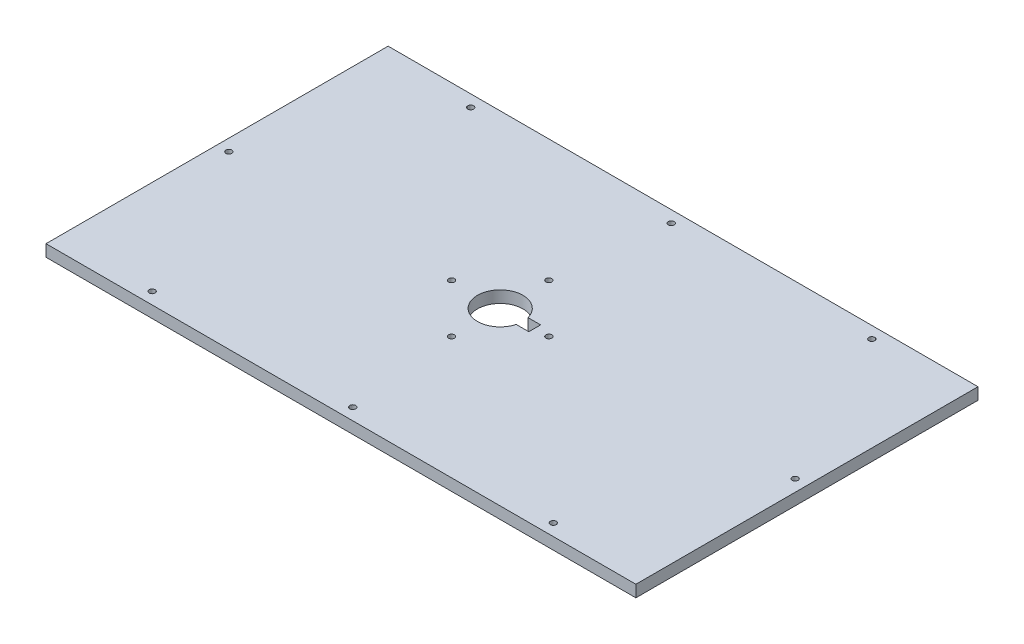
ISO-10303-21;
HEADER;
FILE_DESCRIPTION(('STEP AP214'),'2;1');
FILE_NAME('part.step','',(''),(''),'','','');
FILE_SCHEMA(('AUTOMOTIVE_DESIGN { 1 0 10303 214 1 1 1 1 }'));
ENDSEC;
DATA;
#1=APPLICATION_CONTEXT('core data for automotive mechanical design processes');
#2=APPLICATION_PROTOCOL_DEFINITION('international standard','automotive_design',2000,#1);
#3=PRODUCT_CONTEXT('',#1,'mechanical');
#4=PRODUCT('Part','Part','',(#3));
#5=PRODUCT_RELATED_PRODUCT_CATEGORY('part','',(#4));
#6=PRODUCT_DEFINITION_FORMATION('','',#4);
#7=PRODUCT_DEFINITION_CONTEXT('part definition',#1,'design');
#8=PRODUCT_DEFINITION('design','',#6,#7);
#9=PRODUCT_DEFINITION_SHAPE('','',#8);
#10=(LENGTH_UNIT() NAMED_UNIT(*) SI_UNIT(.MILLI.,.METRE.));
#11=(NAMED_UNIT(*) PLANE_ANGLE_UNIT() SI_UNIT($,.RADIAN.));
#12=(NAMED_UNIT(*) SI_UNIT($,.STERADIAN.) SOLID_ANGLE_UNIT());
#13=UNCERTAINTY_MEASURE_WITH_UNIT(LENGTH_MEASURE(1.E-05),#10,'distance_accuracy_value','');
#14=(GEOMETRIC_REPRESENTATION_CONTEXT(3) GLOBAL_UNCERTAINTY_ASSIGNED_CONTEXT((#13)) GLOBAL_UNIT_ASSIGNED_CONTEXT((#10,
#11,#12)) REPRESENTATION_CONTEXT('',''));
#15=CARTESIAN_POINT('',(0.,0.,0.));
#16=DIRECTION('',(0.,0.,1.));
#17=DIRECTION('',(1.,0.,0.));
#18=AXIS2_PLACEMENT_3D('',#15,#16,#17);
#19=CARTESIAN_POINT('',(0.,10.,0.));
#20=DIRECTION('',(0.,-1.,0.));
#21=DIRECTION('',(0.,0.,-1.));
#22=AXIS2_PLACEMENT_3D('',#19,#20,#21);
#23=PLANE('',#22);
#24=CARTESIAN_POINT('',(-10.,10.,41.25));
#25=DIRECTION('',(0.,1.,0.));
#26=DIRECTION('',(0.,0.,1.));
#27=AXIS2_PLACEMENT_3D('',#24,#25,#26);
#28=CIRCLE('',#27,2.5);
#29=CARTESIAN_POINT('',(-10.,10.,43.75));
#30=VERTEX_POINT('',#29);
#31=EDGE_CURVE('E141',#30,#30,#28,.T.);
#32=ORIENTED_EDGE('',*,*,#31,.F.);
#33=EDGE_LOOP('',(#32));
#34=FACE_BOUND('',#33,.T.);
#35=CARTESIAN_POINT('',(1.11022302462516E-13,10.,135.));
#36=DIRECTION('',(0.,1.,0.));
#37=DIRECTION('',(0.,0.,1.));
#38=AXIS2_PLACEMENT_3D('',#35,#36,#37);
#39=CIRCLE('',#38,2.5);
#40=CARTESIAN_POINT('',(1.11022302462516E-13,10.,137.5));
#41=VERTEX_POINT('',#40);
#42=EDGE_CURVE('E147',#41,#41,#39,.T.);
#43=ORIENTED_EDGE('',*,*,#42,.F.);
#44=EDGE_LOOP('',(#43));
#45=FACE_BOUND('',#44,.T.);
#46=CARTESIAN_POINT('',(1.11022302462516E-13,10.,-135.));
#47=DIRECTION('',(0.,1.,0.));
#48=DIRECTION('',(0.,0.,1.));
#49=AXIS2_PLACEMENT_3D('',#46,#47,#48);
#50=CIRCLE('',#49,2.5);
#51=CARTESIAN_POINT('',(1.11022302462516E-13,10.,-132.5));
#52=VERTEX_POINT('',#51);
#53=EDGE_CURVE('E153',#52,#52,#50,.T.);
#54=ORIENTED_EDGE('',*,*,#53,.F.);
#55=EDGE_LOOP('',(#54));
#56=FACE_BOUND('',#55,.T.);
#57=CARTESIAN_POINT('',(170.,10.,135.));
#58=DIRECTION('',(0.,1.,0.));
#59=DIRECTION('',(0.,0.,1.));
#60=AXIS2_PLACEMENT_3D('',#57,#58,#59);
#61=CIRCLE('',#60,2.5);
#62=CARTESIAN_POINT('',(170.,10.,137.5));
#63=VERTEX_POINT('',#62);
#64=EDGE_CURVE('E159',#63,#63,#61,.T.);
#65=ORIENTED_EDGE('',*,*,#64,.F.);
#66=EDGE_LOOP('',(#65));
#67=FACE_BOUND('',#66,.T.);
#68=CARTESIAN_POINT('',(240.,10.,0.));
#69=DIRECTION('',(0.,1.,0.));
#70=DIRECTION('',(0.,0.,1.));
#71=AXIS2_PLACEMENT_3D('',#68,#69,#70);
#72=CIRCLE('',#71,2.5);
#73=CARTESIAN_POINT('',(240.,10.,2.5));
#74=VERTEX_POINT('',#73);
#75=EDGE_CURVE('E165',#74,#74,#72,.T.);
#76=ORIENTED_EDGE('',*,*,#75,.F.);
#77=EDGE_LOOP('',(#76));
#78=FACE_BOUND('',#77,.T.);
#79=CARTESIAN_POINT('',(170.,10.,-135.));
#80=DIRECTION('',(0.,1.,0.));
#81=DIRECTION('',(0.,0.,1.));
#82=AXIS2_PLACEMENT_3D('',#79,#80,#81);
#83=CIRCLE('',#82,2.5);
#84=CARTESIAN_POINT('',(170.,10.,-132.5));
#85=VERTEX_POINT('',#84);
#86=EDGE_CURVE('E171',#85,#85,#83,.T.);
#87=ORIENTED_EDGE('',*,*,#86,.F.);
#88=EDGE_LOOP('',(#87));
#89=FACE_BOUND('',#88,.T.);
#90=CARTESIAN_POINT('',(-170.,10.,-135.));
#91=DIRECTION('',(0.,1.,0.));
#92=DIRECTION('',(0.,0.,1.));
#93=AXIS2_PLACEMENT_3D('',#90,#91,#92);
#94=CIRCLE('',#93,2.5);
#95=CARTESIAN_POINT('',(-170.,10.,-132.5));
#96=VERTEX_POINT('',#95);
#97=EDGE_CURVE('E177',#96,#96,#94,.T.);
#98=ORIENTED_EDGE('',*,*,#97,.F.);
#99=EDGE_LOOP('',(#98));
#100=FACE_BOUND('',#99,.T.);
#101=CARTESIAN_POINT('',(-170.,10.,135.));
#102=DIRECTION('',(0.,1.,0.));
#103=DIRECTION('',(0.,0.,1.));
#104=AXIS2_PLACEMENT_3D('',#101,#102,#103);
#105=CIRCLE('',#104,2.5);
#106=CARTESIAN_POINT('',(-170.,10.,137.5));
#107=VERTEX_POINT('',#106);
#108=EDGE_CURVE('E183',#107,#107,#105,.T.);
#109=ORIENTED_EDGE('',*,*,#108,.F.);
#110=EDGE_LOOP('',(#109));
#111=FACE_BOUND('',#110,.T.);
#112=CARTESIAN_POINT('',(-240.,10.,0.));
#113=DIRECTION('',(0.,1.,0.));
#114=DIRECTION('',(0.,0.,1.));
#115=AXIS2_PLACEMENT_3D('',#112,#113,#114);
#116=CIRCLE('',#115,2.5);
#117=CARTESIAN_POINT('',(-240.,10.,2.5));
#118=VERTEX_POINT('',#117);
#119=EDGE_CURVE('E189',#118,#118,#116,.T.);
#120=ORIENTED_EDGE('',*,*,#119,.F.);
#121=EDGE_LOOP('',(#120));
#122=FACE_BOUND('',#121,.T.);
#123=CARTESIAN_POINT('',(31.2500000000001,10.,0.));
#124=DIRECTION('',(0.,1.,0.));
#125=DIRECTION('',(0.,0.,1.));
#126=AXIS2_PLACEMENT_3D('',#123,#124,#125);
#127=CIRCLE('',#126,2.5);
#128=CARTESIAN_POINT('',(31.2500000000001,10.,2.5));
#129=VERTEX_POINT('',#128);
#130=EDGE_CURVE('E195',#129,#129,#127,.T.);
#131=ORIENTED_EDGE('',*,*,#130,.F.);
#132=EDGE_LOOP('',(#131));
#133=FACE_BOUND('',#132,.T.);
#134=DIRECTION('',(0.,0.,-1.));
#135=VECTOR('',#134,1.);
#136=CARTESIAN_POINT('',(250.,10.,145.));
#137=LINE('',#136,#135);
#138=CARTESIAN_POINT('',(250.,10.,145.));
#139=VERTEX_POINT('',#138);
#140=CARTESIAN_POINT('',(250.,10.,-145.));
#141=VERTEX_POINT('',#140);
#142=EDGE_CURVE('E201',#139,#141,#137,.T.);
#143=ORIENTED_EDGE('',*,*,#142,.T.);
#144=DIRECTION('',(-1.,0.,0.));
#145=VECTOR('',#144,1.);
#146=CARTESIAN_POINT('',(-250.,10.,-145.));
#147=LINE('',#146,#145);
#148=CARTESIAN_POINT('',(-250.,10.,-145.));
#149=VERTEX_POINT('',#148);
#150=EDGE_CURVE('E204',#141,#149,#147,.T.);
#151=ORIENTED_EDGE('',*,*,#150,.T.);
#152=DIRECTION('',(0.,0.,1.));
#153=VECTOR('',#152,1.);
#154=CARTESIAN_POINT('',(-250.,10.,145.));
#155=LINE('',#154,#153);
#156=CARTESIAN_POINT('',(-250.,10.,145.));
#157=VERTEX_POINT('',#156);
#158=EDGE_CURVE('E207',#149,#157,#155,.T.);
#159=ORIENTED_EDGE('',*,*,#158,.T.);
#160=DIRECTION('',(1.,0.,0.));
#161=VECTOR('',#160,1.);
#162=CARTESIAN_POINT('',(-250.,10.,145.));
#163=LINE('',#162,#161);
#164=EDGE_CURVE('E209',#157,#139,#163,.T.);
#165=ORIENTED_EDGE('',*,*,#164,.T.);
#166=EDGE_LOOP('',(#143,#151,#159,#165));
#167=FACE_BOUND('',#166,.T.);
#168=DIRECTION('',(0.,0.,-1.));
#169=VECTOR('',#168,1.);
#170=CARTESIAN_POINT('',(19.2500000000001,10.,4.99999999999999));
#171=LINE('',#170,#169);
#172=CARTESIAN_POINT('',(19.2500000000001,10.,4.99999999999999));
#173=VERTEX_POINT('',#172);
#174=CARTESIAN_POINT('',(19.2500000000001,10.,-5.00000000000001));
#175=VERTEX_POINT('',#174);
#176=EDGE_CURVE('E102',#173,#175,#171,.T.);
#177=ORIENTED_EDGE('',*,*,#176,.F.);
#178=DIRECTION('',(1.,0.,0.));
#179=VECTOR('',#178,1.);
#180=CARTESIAN_POINT('',(8.58931144502141,10.,4.99999999999999));
#181=LINE('',#180,#179);
#182=CARTESIAN_POINT('',(8.58931144502141,10.,4.99999999999999));
#183=VERTEX_POINT('',#182);
#184=EDGE_CURVE('E125',#183,#173,#181,.T.);
#185=ORIENTED_EDGE('',*,*,#184,.F.);
#186=CARTESIAN_POINT('',(-9.9999999999999,10.,0.));
#187=DIRECTION('',(0.,1.,0.));
#188=DIRECTION('',(0.,0.,1.));
#189=AXIS2_PLACEMENT_3D('',#186,#187,#188);
#190=CIRCLE('',#189,19.25);
#191=CARTESIAN_POINT('',(8.5893114450214,10.,-5.00000000000001));
#192=VERTEX_POINT('',#191);
#193=EDGE_CURVE('E123',#192,#183,#190,.T.);
#194=ORIENTED_EDGE('',*,*,#193,.F.);
#195=DIRECTION('',(-1.,0.,0.));
#196=VECTOR('',#195,1.);
#197=CARTESIAN_POINT('',(8.5893114450214,10.,-5.00000000000001));
#198=LINE('',#197,#196);
#199=EDGE_CURVE('E110',#175,#192,#198,.T.);
#200=ORIENTED_EDGE('',*,*,#199,.F.);
#201=EDGE_LOOP('',(#177,#185,#194,#200));
#202=FACE_BOUND('',#201,.T.);
#203=CARTESIAN_POINT('',(-51.2499999999999,10.,-2.98150546547524E-13));
#204=DIRECTION('',(0.,1.,0.));
#205=DIRECTION('',(0.,0.,1.));
#206=AXIS2_PLACEMENT_3D('',#203,#204,#205);
#207=CIRCLE('',#206,2.5);
#208=CARTESIAN_POINT('',(-51.2499999999999,10.,2.49999999999971));
#209=VERTEX_POINT('',#208);
#210=EDGE_CURVE('E131',#209,#209,#207,.T.);
#211=ORIENTED_EDGE('',*,*,#210,.F.);
#212=EDGE_LOOP('',(#211));
#213=FACE_BOUND('',#212,.T.);
#214=CARTESIAN_POINT('',(-9.99999999999946,10.,-41.25));
#215=DIRECTION('',(0.,1.,0.));
#216=DIRECTION('',(0.,0.,1.));
#217=AXIS2_PLACEMENT_3D('',#214,#215,#216);
#218=CIRCLE('',#217,2.5);
#219=CARTESIAN_POINT('',(-9.99999999999946,10.,-38.75));
#220=VERTEX_POINT('',#219);
#221=EDGE_CURVE('E339',#220,#220,#218,.T.);
#222=ORIENTED_EDGE('',*,*,#221,.F.);
#223=EDGE_LOOP('',(#222));
#224=FACE_BOUND('',#223,.T.);
#225=ADVANCED_FACE('F37',(#34,#45,#56,#67,#78,#89,#100,#111,#122,#133,#167,#202,#213,#224),#23,.F.);
#226=CARTESIAN_POINT('',(0.,0.,0.));
#227=DIRECTION('',(0.,-1.,0.));
#228=DIRECTION('',(0.,0.,-1.));
#229=AXIS2_PLACEMENT_3D('',#226,#227,#228);
#230=PLANE('',#229);
#231=CARTESIAN_POINT('',(-51.2499999999999,0.,-2.98150546547524E-13));
#232=DIRECTION('',(0.,1.,0.));
#233=DIRECTION('',(0.,0.,1.));
#234=AXIS2_PLACEMENT_3D('',#231,#232,#233);
#235=CIRCLE('',#234,2.5);
#236=CARTESIAN_POINT('',(-51.2499999999999,0.,2.49999999999971));
#237=VERTEX_POINT('',#236);
#238=EDGE_CURVE('E345',#237,#237,#235,.T.);
#239=ORIENTED_EDGE('',*,*,#238,.T.);
#240=EDGE_LOOP('',(#239));
#241=FACE_BOUND('',#240,.T.);
#242=CARTESIAN_POINT('',(1.11022302462516E-13,0.,135.));
#243=DIRECTION('',(0.,1.,0.));
#244=DIRECTION('',(0.,0.,1.));
#245=AXIS2_PLACEMENT_3D('',#242,#243,#244);
#246=CIRCLE('',#245,2.5);
#247=CARTESIAN_POINT('',(1.11022302462516E-13,0.,137.5));
#248=VERTEX_POINT('',#247);
#249=EDGE_CURVE('E144',#248,#248,#246,.T.);
#250=ORIENTED_EDGE('',*,*,#249,.T.);
#251=EDGE_LOOP('',(#250));
#252=FACE_BOUND('',#251,.T.);
#253=CARTESIAN_POINT('',(170.,0.,135.));
#254=DIRECTION('',(0.,1.,0.));
#255=DIRECTION('',(0.,0.,1.));
#256=AXIS2_PLACEMENT_3D('',#253,#254,#255);
#257=CIRCLE('',#256,2.5);
#258=CARTESIAN_POINT('',(170.,0.,137.5));
#259=VERTEX_POINT('',#258);
#260=EDGE_CURVE('E156',#259,#259,#257,.T.);
#261=ORIENTED_EDGE('',*,*,#260,.T.);
#262=EDGE_LOOP('',(#261));
#263=FACE_BOUND('',#262,.T.);
#264=CARTESIAN_POINT('',(170.,0.,-135.));
#265=DIRECTION('',(0.,1.,0.));
#266=DIRECTION('',(0.,0.,1.));
#267=AXIS2_PLACEMENT_3D('',#264,#265,#266);
#268=CIRCLE('',#267,2.5);
#269=CARTESIAN_POINT('',(170.,0.,-132.5));
#270=VERTEX_POINT('',#269);
#271=EDGE_CURVE('E168',#270,#270,#268,.T.);
#272=ORIENTED_EDGE('',*,*,#271,.T.);
#273=EDGE_LOOP('',(#272));
#274=FACE_BOUND('',#273,.T.);
#275=CARTESIAN_POINT('',(-170.,0.,135.));
#276=DIRECTION('',(0.,1.,0.));
#277=DIRECTION('',(0.,0.,1.));
#278=AXIS2_PLACEMENT_3D('',#275,#276,#277);
#279=CIRCLE('',#278,2.5);
#280=CARTESIAN_POINT('',(-170.,0.,137.5));
#281=VERTEX_POINT('',#280);
#282=EDGE_CURVE('E180',#281,#281,#279,.T.);
#283=ORIENTED_EDGE('',*,*,#282,.T.);
#284=EDGE_LOOP('',(#283));
#285=FACE_BOUND('',#284,.T.);
#286=CARTESIAN_POINT('',(31.2500000000001,0.,0.));
#287=DIRECTION('',(0.,1.,0.));
#288=DIRECTION('',(0.,0.,1.));
#289=AXIS2_PLACEMENT_3D('',#286,#287,#288);
#290=CIRCLE('',#289,2.5);
#291=CARTESIAN_POINT('',(31.2500000000001,0.,2.5));
#292=VERTEX_POINT('',#291);
#293=EDGE_CURVE('E192',#292,#292,#290,.T.);
#294=ORIENTED_EDGE('',*,*,#293,.T.);
#295=EDGE_LOOP('',(#294));
#296=FACE_BOUND('',#295,.T.);
#297=DIRECTION('',(0.,0.,-1.));
#298=VECTOR('',#297,1.);
#299=CARTESIAN_POINT('',(250.,0.,145.));
#300=LINE('',#299,#298);
#301=CARTESIAN_POINT('',(250.,0.,145.));
#302=VERTEX_POINT('',#301);
#303=CARTESIAN_POINT('',(250.,0.,-145.));
#304=VERTEX_POINT('',#303);
#305=EDGE_CURVE('E198',#302,#304,#300,.T.);
#306=ORIENTED_EDGE('',*,*,#305,.F.);
#307=DIRECTION('',(1.,0.,0.));
#308=VECTOR('',#307,1.);
#309=CARTESIAN_POINT('',(-250.,0.,145.));
#310=LINE('',#309,#308);
#311=CARTESIAN_POINT('',(-250.,0.,145.));
#312=VERTEX_POINT('',#311);
#313=EDGE_CURVE('E205',#312,#302,#310,.T.);
#314=ORIENTED_EDGE('',*,*,#313,.F.);
#315=DIRECTION('',(0.,0.,1.));
#316=VECTOR('',#315,1.);
#317=CARTESIAN_POINT('',(-250.,0.,145.));
#318=LINE('',#317,#316);
#319=CARTESIAN_POINT('',(-250.,0.,-145.));
#320=VERTEX_POINT('',#319);
#321=EDGE_CURVE('E216',#320,#312,#318,.T.);
#322=ORIENTED_EDGE('',*,*,#321,.F.);
#323=DIRECTION('',(-1.,0.,0.));
#324=VECTOR('',#323,1.);
#325=CARTESIAN_POINT('',(-250.,0.,-145.));
#326=LINE('',#325,#324);
#327=EDGE_CURVE('E214',#304,#320,#326,.T.);
#328=ORIENTED_EDGE('',*,*,#327,.F.);
#329=EDGE_LOOP('',(#306,#314,#322,#328));
#330=FACE_BOUND('',#329,.T.);
#331=CARTESIAN_POINT('',(-240.,0.,0.));
#332=DIRECTION('',(0.,1.,0.));
#333=DIRECTION('',(0.,0.,1.));
#334=AXIS2_PLACEMENT_3D('',#331,#332,#333);
#335=CIRCLE('',#334,2.5);
#336=CARTESIAN_POINT('',(-240.,0.,2.5));
#337=VERTEX_POINT('',#336);
#338=EDGE_CURVE('E186',#337,#337,#335,.T.);
#339=ORIENTED_EDGE('',*,*,#338,.T.);
#340=EDGE_LOOP('',(#339));
#341=FACE_BOUND('',#340,.T.);
#342=CARTESIAN_POINT('',(-170.,0.,-135.));
#343=DIRECTION('',(0.,1.,0.));
#344=DIRECTION('',(0.,0.,1.));
#345=AXIS2_PLACEMENT_3D('',#342,#343,#344);
#346=CIRCLE('',#345,2.5);
#347=CARTESIAN_POINT('',(-170.,0.,-132.5));
#348=VERTEX_POINT('',#347);
#349=EDGE_CURVE('E174',#348,#348,#346,.T.);
#350=ORIENTED_EDGE('',*,*,#349,.T.);
#351=EDGE_LOOP('',(#350));
#352=FACE_BOUND('',#351,.T.);
#353=CARTESIAN_POINT('',(240.,0.,0.));
#354=DIRECTION('',(0.,1.,0.));
#355=DIRECTION('',(0.,0.,1.));
#356=AXIS2_PLACEMENT_3D('',#353,#354,#355);
#357=CIRCLE('',#356,2.5);
#358=CARTESIAN_POINT('',(240.,0.,2.5));
#359=VERTEX_POINT('',#358);
#360=EDGE_CURVE('E162',#359,#359,#357,.T.);
#361=ORIENTED_EDGE('',*,*,#360,.T.);
#362=EDGE_LOOP('',(#361));
#363=FACE_BOUND('',#362,.T.);
#364=CARTESIAN_POINT('',(1.11022302462516E-13,0.,-135.));
#365=DIRECTION('',(0.,1.,0.));
#366=DIRECTION('',(0.,0.,1.));
#367=AXIS2_PLACEMENT_3D('',#364,#365,#366);
#368=CIRCLE('',#367,2.5);
#369=CARTESIAN_POINT('',(1.11022302462516E-13,0.,-132.5));
#370=VERTEX_POINT('',#369);
#371=EDGE_CURVE('E150',#370,#370,#368,.T.);
#372=ORIENTED_EDGE('',*,*,#371,.T.);
#373=EDGE_LOOP('',(#372));
#374=FACE_BOUND('',#373,.T.);
#375=CARTESIAN_POINT('',(-10.,0.,41.25));
#376=DIRECTION('',(0.,1.,0.));
#377=DIRECTION('',(0.,0.,1.));
#378=AXIS2_PLACEMENT_3D('',#375,#376,#377);
#379=CIRCLE('',#378,2.5);
#380=CARTESIAN_POINT('',(-10.,0.,43.75));
#381=VERTEX_POINT('',#380);
#382=EDGE_CURVE('E118',#381,#381,#379,.T.);
#383=ORIENTED_EDGE('',*,*,#382,.T.);
#384=EDGE_LOOP('',(#383));
#385=FACE_BOUND('',#384,.T.);
#386=DIRECTION('',(1.,0.,0.));
#387=VECTOR('',#386,1.);
#388=CARTESIAN_POINT('',(8.58931144502141,0.,4.99999999999999));
#389=LINE('',#388,#387);
#390=CARTESIAN_POINT('',(8.58931144502141,0.,4.99999999999999));
#391=VERTEX_POINT('',#390);
#392=CARTESIAN_POINT('',(19.2500000000001,0.,4.99999999999999));
#393=VERTEX_POINT('',#392);
#394=EDGE_CURVE('E111',#391,#393,#389,.T.);
#395=ORIENTED_EDGE('',*,*,#394,.T.);
#396=DIRECTION('',(0.,0.,-1.));
#397=VECTOR('',#396,1.);
#398=CARTESIAN_POINT('',(19.2500000000001,0.,4.99999999999999));
#399=LINE('',#398,#397);
#400=CARTESIAN_POINT('',(19.2500000000001,0.,-5.00000000000001));
#401=VERTEX_POINT('',#400);
#402=EDGE_CURVE('E60',#393,#401,#399,.T.);
#403=ORIENTED_EDGE('',*,*,#402,.T.);
#404=DIRECTION('',(-1.,0.,0.));
#405=VECTOR('',#404,1.);
#406=CARTESIAN_POINT('',(8.5893114450214,0.,-5.00000000000001));
#407=LINE('',#406,#405);
#408=CARTESIAN_POINT('',(8.5893114450214,0.,-5.00000000000001));
#409=VERTEX_POINT('',#408);
#410=EDGE_CURVE('E117',#401,#409,#407,.T.);
#411=ORIENTED_EDGE('',*,*,#410,.T.);
#412=CARTESIAN_POINT('',(-9.9999999999999,0.,0.));
#413=DIRECTION('',(0.,1.,0.));
#414=DIRECTION('',(0.,0.,1.));
#415=AXIS2_PLACEMENT_3D('',#412,#413,#414);
#416=CIRCLE('',#415,19.25);
#417=EDGE_CURVE('E133',#409,#391,#416,.T.);
#418=ORIENTED_EDGE('',*,*,#417,.T.);
#419=EDGE_LOOP('',(#395,#403,#411,#418));
#420=FACE_BOUND('',#419,.T.);
#421=CARTESIAN_POINT('',(-9.99999999999946,0.,-41.25));
#422=DIRECTION('',(0.,1.,0.));
#423=DIRECTION('',(0.,0.,1.));
#424=AXIS2_PLACEMENT_3D('',#421,#422,#423);
#425=CIRCLE('',#424,2.5);
#426=CARTESIAN_POINT('',(-9.99999999999946,0.,-38.75));
#427=VERTEX_POINT('',#426);
#428=EDGE_CURVE('E342',#427,#427,#425,.T.);
#429=ORIENTED_EDGE('',*,*,#428,.T.);
#430=EDGE_LOOP('',(#429));
#431=FACE_BOUND('',#430,.T.);
#432=ADVANCED_FACE('F234',(#241,#252,#263,#274,#285,#296,#330,#341,#352,#363,#374,#385,#420,
#431),#230,.T.);
#433=CARTESIAN_POINT('',(250.,10.,145.));
#434=DIRECTION('',(-1.,0.,0.));
#435=DIRECTION('',(0.,0.,1.));
#436=AXIS2_PLACEMENT_3D('',#433,#434,#435);
#437=PLANE('',#436);
#438=ORIENTED_EDGE('',*,*,#305,.T.);
#439=DIRECTION('',(0.,-1.,0.));
#440=VECTOR('',#439,1.);
#441=CARTESIAN_POINT('',(250.,10.,-145.));
#442=LINE('',#441,#440);
#443=EDGE_CURVE('E11',#141,#304,#442,.T.);
#444=ORIENTED_EDGE('',*,*,#443,.F.);
#445=ORIENTED_EDGE('',*,*,#142,.F.);
#446=DIRECTION('',(0.,-1.,0.));
#447=VECTOR('',#446,1.);
#448=CARTESIAN_POINT('',(250.,10.,145.));
#449=LINE('',#448,#447);
#450=EDGE_CURVE('E211',#139,#302,#449,.T.);
#451=ORIENTED_EDGE('',*,*,#450,.T.);
#452=EDGE_LOOP('',(#438,#444,#445,#451));
#453=FACE_BOUND('',#452,.T.);
#454=ADVANCED_FACE('F39',(#453),#437,.F.);
#455=CARTESIAN_POINT('',(-250.,10.,-145.));
#456=DIRECTION('',(0.,0.,1.));
#457=DIRECTION('',(1.,0.,0.));
#458=AXIS2_PLACEMENT_3D('',#455,#456,#457);
#459=PLANE('',#458);
#460=ORIENTED_EDGE('',*,*,#327,.T.);
#461=DIRECTION('',(0.,-1.,0.));
#462=VECTOR('',#461,1.);
#463=CARTESIAN_POINT('',(-250.,10.,-145.));
#464=LINE('',#463,#462);
#465=EDGE_CURVE('E45',#149,#320,#464,.T.);
#466=ORIENTED_EDGE('',*,*,#465,.F.);
#467=ORIENTED_EDGE('',*,*,#150,.F.);
#468=ORIENTED_EDGE('',*,*,#443,.T.);
#469=EDGE_LOOP('',(#460,#466,#467,#468));
#470=FACE_BOUND('',#469,.T.);
#471=ADVANCED_FACE('F244',(#470),#459,.F.);
#472=CARTESIAN_POINT('',(-250.,10.,145.));
#473=DIRECTION('',(1.,0.,0.));
#474=DIRECTION('',(0.,0.,-1.));
#475=AXIS2_PLACEMENT_3D('',#472,#473,#474);
#476=PLANE('',#475);
#477=ORIENTED_EDGE('',*,*,#321,.T.);
#478=DIRECTION('',(0.,-1.,0.));
#479=VECTOR('',#478,1.);
#480=CARTESIAN_POINT('',(-250.,10.,145.));
#481=LINE('',#480,#479);
#482=EDGE_CURVE('E221',#157,#312,#481,.T.);
#483=ORIENTED_EDGE('',*,*,#482,.F.);
#484=ORIENTED_EDGE('',*,*,#158,.F.);
#485=ORIENTED_EDGE('',*,*,#465,.T.);
#486=EDGE_LOOP('',(#477,#483,#484,#485));
#487=FACE_BOUND('',#486,.T.);
#488=ADVANCED_FACE('F228',(#487),#476,.F.);
#489=CARTESIAN_POINT('',(-250.,10.,145.));
#490=DIRECTION('',(0.,0.,-1.));
#491=DIRECTION('',(-1.,0.,0.));
#492=AXIS2_PLACEMENT_3D('',#489,#490,#491);
#493=PLANE('',#492);
#494=ORIENTED_EDGE('',*,*,#313,.T.);
#495=ORIENTED_EDGE('',*,*,#450,.F.);
#496=ORIENTED_EDGE('',*,*,#164,.F.);
#497=ORIENTED_EDGE('',*,*,#482,.T.);
#498=EDGE_LOOP('',(#494,#495,#496,#497));
#499=FACE_BOUND('',#498,.T.);
#500=ADVANCED_FACE('F238',(#499),#493,.F.);
#501=CARTESIAN_POINT('',(31.2500000000001,10.,0.));
#502=DIRECTION('',(0.,-1.,0.));
#503=DIRECTION('',(0.,0.,-1.));
#504=AXIS2_PLACEMENT_3D('',#501,#502,#503);
#505=CYLINDRICAL_SURFACE('',#504,2.5);
#506=ORIENTED_EDGE('',*,*,#130,.T.);
#507=EDGE_LOOP('',(#506));
#508=FACE_BOUND('',#507,.T.);
#509=ORIENTED_EDGE('',*,*,#293,.F.);
#510=EDGE_LOOP('',(#509));
#511=FACE_BOUND('',#510,.T.);
#512=ADVANCED_FACE('F262',(#508,#511),#505,.F.);
#513=CARTESIAN_POINT('',(-240.,10.,0.));
#514=DIRECTION('',(0.,-1.,0.));
#515=DIRECTION('',(0.,0.,-1.));
#516=AXIS2_PLACEMENT_3D('',#513,#514,#515);
#517=CYLINDRICAL_SURFACE('',#516,2.5);
#518=ORIENTED_EDGE('',*,*,#119,.T.);
#519=EDGE_LOOP('',(#518));
#520=FACE_BOUND('',#519,.T.);
#521=ORIENTED_EDGE('',*,*,#338,.F.);
#522=EDGE_LOOP('',(#521));
#523=FACE_BOUND('',#522,.T.);
#524=ADVANCED_FACE('F269',(#520,#523),#517,.F.);
#525=CARTESIAN_POINT('',(-170.,10.,135.));
#526=DIRECTION('',(0.,-1.,0.));
#527=DIRECTION('',(0.,0.,-1.));
#528=AXIS2_PLACEMENT_3D('',#525,#526,#527);
#529=CYLINDRICAL_SURFACE('',#528,2.5);
#530=ORIENTED_EDGE('',*,*,#108,.T.);
#531=EDGE_LOOP('',(#530));
#532=FACE_BOUND('',#531,.T.);
#533=ORIENTED_EDGE('',*,*,#282,.F.);
#534=EDGE_LOOP('',(#533));
#535=FACE_BOUND('',#534,.T.);
#536=ADVANCED_FACE('F274',(#532,#535),#529,.F.);
#537=CARTESIAN_POINT('',(-170.,10.,-135.));
#538=DIRECTION('',(0.,-1.,0.));
#539=DIRECTION('',(0.,0.,-1.));
#540=AXIS2_PLACEMENT_3D('',#537,#538,#539);
#541=CYLINDRICAL_SURFACE('',#540,2.5);
#542=ORIENTED_EDGE('',*,*,#97,.T.);
#543=EDGE_LOOP('',(#542));
#544=FACE_BOUND('',#543,.T.);
#545=ORIENTED_EDGE('',*,*,#349,.F.);
#546=EDGE_LOOP('',(#545));
#547=FACE_BOUND('',#546,.T.);
#548=ADVANCED_FACE('F284',(#544,#547),#541,.F.);
#549=CARTESIAN_POINT('',(170.,10.,-135.));
#550=DIRECTION('',(0.,-1.,0.));
#551=DIRECTION('',(0.,0.,-1.));
#552=AXIS2_PLACEMENT_3D('',#549,#550,#551);
#553=CYLINDRICAL_SURFACE('',#552,2.5);
#554=ORIENTED_EDGE('',*,*,#86,.T.);
#555=EDGE_LOOP('',(#554));
#556=FACE_BOUND('',#555,.T.);
#557=ORIENTED_EDGE('',*,*,#271,.F.);
#558=EDGE_LOOP('',(#557));
#559=FACE_BOUND('',#558,.T.);
#560=ADVANCED_FACE('F291',(#556,#559),#553,.F.);
#561=CARTESIAN_POINT('',(240.,10.,0.));
#562=DIRECTION('',(0.,-1.,0.));
#563=DIRECTION('',(0.,0.,-1.));
#564=AXIS2_PLACEMENT_3D('',#561,#562,#563);
#565=CYLINDRICAL_SURFACE('',#564,2.5);
#566=ORIENTED_EDGE('',*,*,#75,.T.);
#567=EDGE_LOOP('',(#566));
#568=FACE_BOUND('',#567,.T.);
#569=ORIENTED_EDGE('',*,*,#360,.F.);
#570=EDGE_LOOP('',(#569));
#571=FACE_BOUND('',#570,.T.);
#572=ADVANCED_FACE('F295',(#568,#571),#565,.F.);
#573=CARTESIAN_POINT('',(170.,10.,135.));
#574=DIRECTION('',(0.,-1.,0.));
#575=DIRECTION('',(0.,0.,-1.));
#576=AXIS2_PLACEMENT_3D('',#573,#574,#575);
#577=CYLINDRICAL_SURFACE('',#576,2.5);
#578=ORIENTED_EDGE('',*,*,#64,.T.);
#579=EDGE_LOOP('',(#578));
#580=FACE_BOUND('',#579,.T.);
#581=ORIENTED_EDGE('',*,*,#260,.F.);
#582=EDGE_LOOP('',(#581));
#583=FACE_BOUND('',#582,.T.);
#584=ADVANCED_FACE('F299',(#580,#583),#577,.F.);
#585=CARTESIAN_POINT('',(1.11022302462516E-13,10.,-135.));
#586=DIRECTION('',(0.,-1.,0.));
#587=DIRECTION('',(0.,0.,-1.));
#588=AXIS2_PLACEMENT_3D('',#585,#586,#587);
#589=CYLINDRICAL_SURFACE('',#588,2.5);
#590=ORIENTED_EDGE('',*,*,#53,.T.);
#591=EDGE_LOOP('',(#590));
#592=FACE_BOUND('',#591,.T.);
#593=ORIENTED_EDGE('',*,*,#371,.F.);
#594=EDGE_LOOP('',(#593));
#595=FACE_BOUND('',#594,.T.);
#596=ADVANCED_FACE('F303',(#592,#595),#589,.F.);
#597=CARTESIAN_POINT('',(1.11022302462516E-13,10.,135.));
#598=DIRECTION('',(0.,-1.,0.));
#599=DIRECTION('',(0.,0.,-1.));
#600=AXIS2_PLACEMENT_3D('',#597,#598,#599);
#601=CYLINDRICAL_SURFACE('',#600,2.5);
#602=ORIENTED_EDGE('',*,*,#42,.T.);
#603=EDGE_LOOP('',(#602));
#604=FACE_BOUND('',#603,.T.);
#605=ORIENTED_EDGE('',*,*,#249,.F.);
#606=EDGE_LOOP('',(#605));
#607=FACE_BOUND('',#606,.T.);
#608=ADVANCED_FACE('F307',(#604,#607),#601,.F.);
#609=CARTESIAN_POINT('',(-10.,10.,41.25));
#610=DIRECTION('',(0.,-1.,0.));
#611=DIRECTION('',(0.,0.,-1.));
#612=AXIS2_PLACEMENT_3D('',#609,#610,#611);
#613=CYLINDRICAL_SURFACE('',#612,2.5);
#614=ORIENTED_EDGE('',*,*,#31,.T.);
#615=EDGE_LOOP('',(#614));
#616=FACE_BOUND('',#615,.T.);
#617=ORIENTED_EDGE('',*,*,#382,.F.);
#618=EDGE_LOOP('',(#617));
#619=FACE_BOUND('',#618,.T.);
#620=ADVANCED_FACE('F311',(#616,#619),#613,.F.);
#621=CARTESIAN_POINT('',(19.2500000000001,10.,4.99999999999999));
#622=DIRECTION('',(-1.,0.,0.));
#623=DIRECTION('',(0.,0.,1.));
#624=AXIS2_PLACEMENT_3D('',#621,#622,#623);
#625=PLANE('',#624);
#626=ORIENTED_EDGE('',*,*,#402,.F.);
#627=DIRECTION('',(0.,-1.,0.));
#628=VECTOR('',#627,1.);
#629=CARTESIAN_POINT('',(19.2500000000001,10.,4.99999999999999));
#630=LINE('',#629,#628);
#631=EDGE_CURVE('E106',#173,#393,#630,.T.);
#632=ORIENTED_EDGE('',*,*,#631,.F.);
#633=ORIENTED_EDGE('',*,*,#176,.T.);
#634=DIRECTION('',(0.,-1.,0.));
#635=VECTOR('',#634,1.);
#636=CARTESIAN_POINT('',(19.2500000000001,10.,-5.00000000000001));
#637=LINE('',#636,#635);
#638=EDGE_CURVE('E105',#175,#401,#637,.T.);
#639=ORIENTED_EDGE('',*,*,#638,.T.);
#640=EDGE_LOOP('',(#626,#632,#633,#639));
#641=FACE_BOUND('',#640,.T.);
#642=ADVANCED_FACE('F104',(#641),#625,.T.);
#643=CARTESIAN_POINT('',(8.5893114450214,10.,-5.00000000000001));
#644=DIRECTION('',(0.,0.,1.));
#645=DIRECTION('',(1.,0.,0.));
#646=AXIS2_PLACEMENT_3D('',#643,#644,#645);
#647=PLANE('',#646);
#648=ORIENTED_EDGE('',*,*,#410,.F.);
#649=ORIENTED_EDGE('',*,*,#638,.F.);
#650=ORIENTED_EDGE('',*,*,#199,.T.);
#651=DIRECTION('',(0.,-1.,0.));
#652=VECTOR('',#651,1.);
#653=CARTESIAN_POINT('',(8.5893114450214,10.,-5.00000000000001));
#654=LINE('',#653,#652);
#655=EDGE_CURVE('E119',#192,#409,#654,.T.);
#656=ORIENTED_EDGE('',*,*,#655,.T.);
#657=EDGE_LOOP('',(#648,#649,#650,#656));
#658=FACE_BOUND('',#657,.T.);
#659=ADVANCED_FACE('F114',(#658),#647,.T.);
#660=CARTESIAN_POINT('',(-9.9999999999999,10.,0.));
#661=DIRECTION('',(0.,-1.,0.));
#662=DIRECTION('',(0.,0.,-1.));
#663=AXIS2_PLACEMENT_3D('',#660,#661,#662);
#664=CYLINDRICAL_SURFACE('',#663,19.25);
#665=ORIENTED_EDGE('',*,*,#417,.F.);
#666=ORIENTED_EDGE('',*,*,#655,.F.);
#667=ORIENTED_EDGE('',*,*,#193,.T.);
#668=DIRECTION('',(0.,-1.,0.));
#669=VECTOR('',#668,1.);
#670=CARTESIAN_POINT('',(8.58931144502141,10.,4.99999999999999));
#671=LINE('',#670,#669);
#672=EDGE_CURVE('E52',#183,#391,#671,.T.);
#673=ORIENTED_EDGE('',*,*,#672,.T.);
#674=EDGE_LOOP('',(#665,#666,#667,#673));
#675=FACE_BOUND('',#674,.T.);
#676=ADVANCED_FACE('F320',(#675),#664,.F.);
#677=CARTESIAN_POINT('',(8.58931144502141,10.,4.99999999999999));
#678=DIRECTION('',(0.,0.,-1.));
#679=DIRECTION('',(-1.,0.,0.));
#680=AXIS2_PLACEMENT_3D('',#677,#678,#679);
#681=PLANE('',#680);
#682=ORIENTED_EDGE('',*,*,#394,.F.);
#683=ORIENTED_EDGE('',*,*,#672,.F.);
#684=ORIENTED_EDGE('',*,*,#184,.T.);
#685=ORIENTED_EDGE('',*,*,#631,.T.);
#686=EDGE_LOOP('',(#682,#683,#684,#685));
#687=FACE_BOUND('',#686,.T.);
#688=ADVANCED_FACE('F323',(#687),#681,.T.);
#689=CARTESIAN_POINT('',(-51.2499999999999,10.,-2.98150546547524E-13));
#690=DIRECTION('',(0.,-1.,0.));
#691=DIRECTION('',(0.,0.,-1.));
#692=AXIS2_PLACEMENT_3D('',#689,#690,#691);
#693=CYLINDRICAL_SURFACE('',#692,2.5);
#694=ORIENTED_EDGE('',*,*,#210,.T.);
#695=EDGE_LOOP('',(#694));
#696=FACE_BOUND('',#695,.T.);
#697=ORIENTED_EDGE('',*,*,#238,.F.);
#698=EDGE_LOOP('',(#697));
#699=FACE_BOUND('',#698,.T.);
#700=ADVANCED_FACE('F327',(#696,#699),#693,.F.);
#701=CARTESIAN_POINT('',(-9.99999999999946,10.,-41.25));
#702=DIRECTION('',(0.,-1.,0.));
#703=DIRECTION('',(0.,0.,-1.));
#704=AXIS2_PLACEMENT_3D('',#701,#702,#703);
#705=CYLINDRICAL_SURFACE('',#704,2.5);
#706=ORIENTED_EDGE('',*,*,#221,.T.);
#707=EDGE_LOOP('',(#706));
#708=FACE_BOUND('',#707,.T.);
#709=ORIENTED_EDGE('',*,*,#428,.F.);
#710=EDGE_LOOP('',(#709));
#711=FACE_BOUND('',#710,.T.);
#712=ADVANCED_FACE('F330',(#708,#711),#705,.F.);
#713=CLOSED_SHELL('',(#225,#432,#454,#471,#488,#500,#512,#524,#536,#548,#560,#572,#584,#596,
#608,#620,#642,#659,#676,#688,#700,#712));
#714=MANIFOLD_SOLID_BREP('B2',#713);
#715=ADVANCED_BREP_SHAPE_REPRESENTATION('',(#18,#714),#14);
#716=SHAPE_DEFINITION_REPRESENTATION(#9,#715);
ENDSEC;
END-ISO-10303-21;
